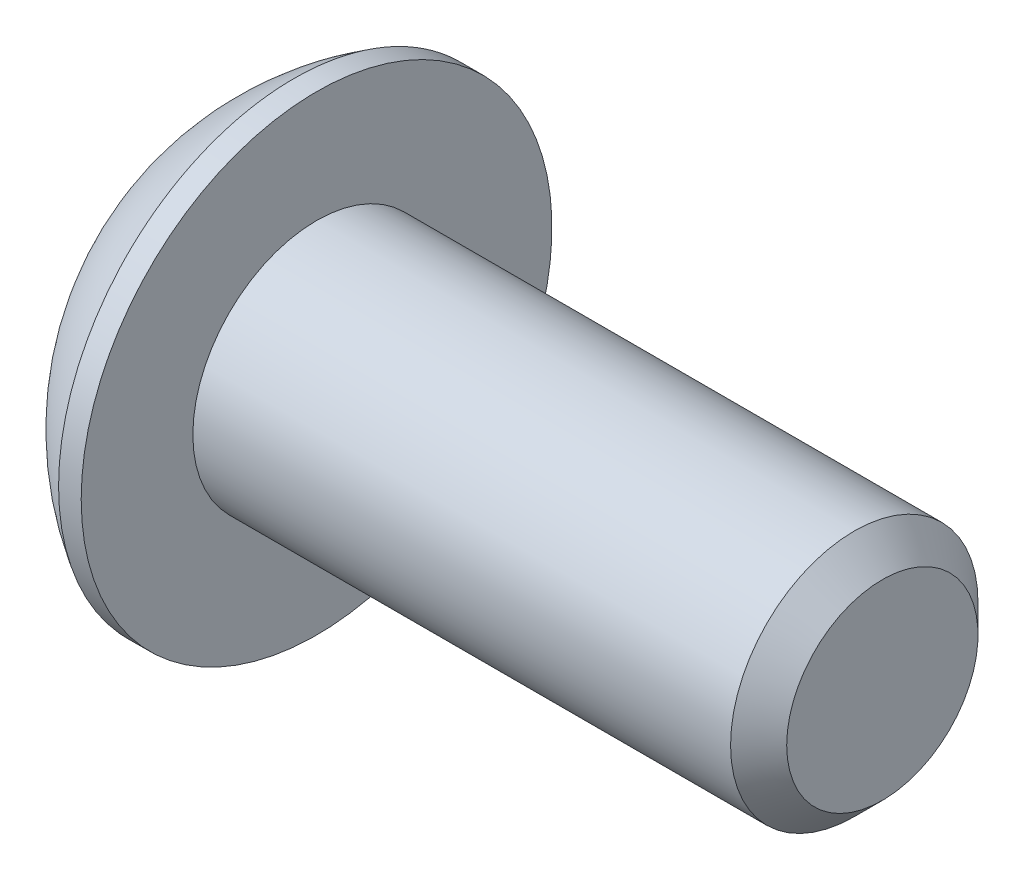
ISO-10303-21;
HEADER;
FILE_DESCRIPTION(('STEP AP214'),'2;1');
FILE_NAME('part.step','',(''),(''),'','','');
FILE_SCHEMA(('AUTOMOTIVE_DESIGN { 1 0 10303 214 1 1 1 1 }'));
ENDSEC;
DATA;
#1=APPLICATION_CONTEXT('core data for automotive mechanical design processes');
#2=APPLICATION_PROTOCOL_DEFINITION('international standard','automotive_design',2000,#1);
#3=PRODUCT_CONTEXT('',#1,'mechanical');
#4=PRODUCT('Part','Part','',(#3));
#5=PRODUCT_RELATED_PRODUCT_CATEGORY('part','',(#4));
#6=PRODUCT_DEFINITION_FORMATION('','',#4);
#7=PRODUCT_DEFINITION_CONTEXT('part definition',#1,'design');
#8=PRODUCT_DEFINITION('design','',#6,#7);
#9=PRODUCT_DEFINITION_SHAPE('','',#8);
#10=(LENGTH_UNIT() NAMED_UNIT(*) SI_UNIT(.MILLI.,.METRE.));
#11=(NAMED_UNIT(*) PLANE_ANGLE_UNIT() SI_UNIT($,.RADIAN.));
#12=(NAMED_UNIT(*) SI_UNIT($,.STERADIAN.) SOLID_ANGLE_UNIT());
#13=UNCERTAINTY_MEASURE_WITH_UNIT(LENGTH_MEASURE(1.E-05),#10,'distance_accuracy_value','');
#14=(GEOMETRIC_REPRESENTATION_CONTEXT(3) GLOBAL_UNCERTAINTY_ASSIGNED_CONTEXT((#13)) GLOBAL_UNIT_ASSIGNED_CONTEXT((#10,
#11,#12)) REPRESENTATION_CONTEXT('',''));
#15=CARTESIAN_POINT('',(0.,0.,0.));
#16=DIRECTION('',(0.,0.,1.));
#17=DIRECTION('',(1.,0.,0.));
#18=AXIS2_PLACEMENT_3D('',#15,#16,#17);
#19=CARTESIAN_POINT('',(1.32080000000034,0.,0.));
#20=DIRECTION('',(-1.,0.,0.));
#21=DIRECTION('',(0.,0.,1.));
#22=AXIS2_PLACEMENT_3D('',#19,#20,#21);
#23=CONICAL_SURFACE('',#22,1.1937999999998,1.04719755119608);
#24=CARTESIAN_POINT('',(2.01004075135902,0.,4.44089209850063E-13));
#25=VERTEX_POINT('',#24);
#26=VERTEX_LOOP('',#25);
#27=FACE_BOUND('',#26,.T.);
#28=CARTESIAN_POINT('',(1.32080000000009,0.,0.));
#29=DIRECTION('',(-1.,0.,0.));
#30=DIRECTION('',(0.,0.,1.));
#31=AXIS2_PLACEMENT_3D('',#28,#29,#30);
#32=CIRCLE('',#31,1.19380000000024);
#33=CARTESIAN_POINT('',(1.32080000000004,-1.03386112703797,0.59690000000006));
#34=VERTEX_POINT('',#33);
#35=CARTESIAN_POINT('',(1.32080000000004,0.,1.19380000000012));
#36=VERTEX_POINT('',#35);
#37=EDGE_CURVE('E18',#34,#36,#32,.T.);
#38=ORIENTED_EDGE('',*,*,#37,.T.);
#39=CARTESIAN_POINT('',(1.32080000000009,0.,0.));
#40=DIRECTION('',(-1.,0.,0.));
#41=DIRECTION('',(0.,0.,1.));
#42=AXIS2_PLACEMENT_3D('',#39,#40,#41);
#43=CIRCLE('',#42,1.19380000000024);
#44=CARTESIAN_POINT('',(1.32080000000004,1.03386112703797,0.596900000000061));
#45=VERTEX_POINT('',#44);
#46=EDGE_CURVE('E139',#36,#45,#43,.T.);
#47=ORIENTED_EDGE('',*,*,#46,.T.);
#48=CARTESIAN_POINT('',(1.32080000000009,0.,0.));
#49=DIRECTION('',(-1.,0.,0.));
#50=DIRECTION('',(0.,0.,1.));
#51=AXIS2_PLACEMENT_3D('',#48,#49,#50);
#52=CIRCLE('',#51,1.19380000000024);
#53=CARTESIAN_POINT('',(1.32080000000004,1.03386112703797,-0.596900000000061));
#54=VERTEX_POINT('',#53);
#55=EDGE_CURVE('E368',#45,#54,#52,.T.);
#56=ORIENTED_EDGE('',*,*,#55,.T.);
#57=CARTESIAN_POINT('',(1.32080000000009,0.,0.));
#58=DIRECTION('',(-1.,0.,0.));
#59=DIRECTION('',(0.,0.,1.));
#60=AXIS2_PLACEMENT_3D('',#57,#58,#59);
#61=CIRCLE('',#60,1.19380000000024);
#62=CARTESIAN_POINT('',(1.32080000000004,1.49457637585666E-12,-1.19380000000012));
#63=VERTEX_POINT('',#62);
#64=EDGE_CURVE('E366',#54,#63,#61,.T.);
#65=ORIENTED_EDGE('',*,*,#64,.T.);
#66=CARTESIAN_POINT('',(1.32080000000009,0.,0.));
#67=DIRECTION('',(-1.,0.,0.));
#68=DIRECTION('',(0.,0.,1.));
#69=AXIS2_PLACEMENT_3D('',#66,#67,#68);
#70=CIRCLE('',#69,1.19380000000024);
#71=CARTESIAN_POINT('',(1.32080000000004,-1.03386112703797,-0.59690000000006));
#72=VERTEX_POINT('',#71);
#73=EDGE_CURVE('E91',#63,#72,#70,.T.);
#74=ORIENTED_EDGE('',*,*,#73,.T.);
#75=CARTESIAN_POINT('',(1.32080000000009,0.,0.));
#76=DIRECTION('',(-1.,0.,0.));
#77=DIRECTION('',(0.,0.,1.));
#78=AXIS2_PLACEMENT_3D('',#75,#76,#77);
#79=CIRCLE('',#78,1.19380000000024);
#80=EDGE_CURVE('E87',#72,#34,#79,.T.);
#81=ORIENTED_EDGE('',*,*,#80,.T.);
#82=EDGE_LOOP('',(#38,#47,#56,#65,#74,#81));
#83=FACE_BOUND('',#82,.T.);
#84=ADVANCED_FACE('F14',(#27,#83),#23,.F.);
#85=CARTESIAN_POINT('',(1.3208,-2.06772225407572,-1.1938));
#86=DIRECTION('',(1.,0.,0.));
#87=DIRECTION('',(0.,0.,-1.));
#88=AXIS2_PLACEMENT_3D('',#85,#86,#87);
#89=PLANE('',#88);
#90=DIRECTION('',(0.,0.5,0.866025403784439));
#91=VECTOR('',#90,1.);
#92=CARTESIAN_POINT('',(1.3208,-1.37848150271715,0.));
#93=LINE('',#92,#91);
#94=CARTESIAN_POINT('',(1.3208,-0.689240751358574,1.1938));
#95=VERTEX_POINT('',#94);
#96=EDGE_CURVE('E99',#95,#34,#93,.F.);
#97=ORIENTED_EDGE('',*,*,#96,.F.);
#98=DIRECTION('',(0.,1.,0.));
#99=VECTOR('',#98,1.);
#100=CARTESIAN_POINT('',(1.3208,-0.689240751358574,1.1938));
#101=LINE('',#100,#99);
#102=EDGE_CURVE('E101',#36,#95,#101,.F.);
#103=ORIENTED_EDGE('',*,*,#102,.F.);
#104=ORIENTED_EDGE('',*,*,#37,.F.);
#105=EDGE_LOOP('',(#97,#103,#104));
#106=FACE_BOUND('',#105,.T.);
#107=ADVANCED_FACE('F97',(#106),#89,.F.);
#108=CARTESIAN_POINT('',(1.3208,-2.06772225407572,-1.1938));
#109=DIRECTION('',(1.,0.,0.));
#110=DIRECTION('',(0.,0.,-1.));
#111=AXIS2_PLACEMENT_3D('',#108,#109,#110);
#112=PLANE('',#111);
#113=DIRECTION('',(0.,-0.5,0.866025403784439));
#114=VECTOR('',#113,1.);
#115=CARTESIAN_POINT('',(1.3208,-0.689240751358574,-1.1938));
#116=LINE('',#115,#114);
#117=CARTESIAN_POINT('',(1.3208,-1.37848150271715,0.));
#118=VERTEX_POINT('',#117);
#119=EDGE_CURVE('E107',#118,#72,#116,.F.);
#120=ORIENTED_EDGE('',*,*,#119,.F.);
#121=DIRECTION('',(0.,0.5,0.866025403784439));
#122=VECTOR('',#121,1.);
#123=CARTESIAN_POINT('',(1.3208,-1.37848150271715,0.));
#124=LINE('',#123,#122);
#125=EDGE_CURVE('E104',#34,#118,#124,.F.);
#126=ORIENTED_EDGE('',*,*,#125,.F.);
#127=ORIENTED_EDGE('',*,*,#80,.F.);
#128=EDGE_LOOP('',(#120,#126,#127));
#129=FACE_BOUND('',#128,.T.);
#130=ADVANCED_FACE('F105',(#129),#112,.F.);
#131=CARTESIAN_POINT('',(1.3208,-2.06772225407572,-1.1938));
#132=DIRECTION('',(1.,0.,0.));
#133=DIRECTION('',(0.,0.,-1.));
#134=AXIS2_PLACEMENT_3D('',#131,#132,#133);
#135=PLANE('',#134);
#136=DIRECTION('',(0.,1.,0.));
#137=VECTOR('',#136,1.);
#138=CARTESIAN_POINT('',(1.3208,0.689240751358577,-1.1938));
#139=LINE('',#138,#137);
#140=CARTESIAN_POINT('',(1.3208,-0.689240751358574,-1.1938));
#141=VERTEX_POINT('',#140);
#142=EDGE_CURVE('E336',#141,#63,#139,.T.);
#143=ORIENTED_EDGE('',*,*,#142,.F.);
#144=DIRECTION('',(0.,-0.5,0.866025403784439));
#145=VECTOR('',#144,1.);
#146=CARTESIAN_POINT('',(1.3208,-0.689240751358574,-1.1938));
#147=LINE('',#146,#145);
#148=EDGE_CURVE('E341',#72,#141,#147,.F.);
#149=ORIENTED_EDGE('',*,*,#148,.F.);
#150=ORIENTED_EDGE('',*,*,#73,.F.);
#151=EDGE_LOOP('',(#143,#149,#150));
#152=FACE_BOUND('',#151,.T.);
#153=ADVANCED_FACE('F182',(#152),#135,.F.);
#154=CARTESIAN_POINT('',(1.3208,-2.06772225407572,-1.1938));
#155=DIRECTION('',(1.,0.,0.));
#156=DIRECTION('',(0.,0.,-1.));
#157=AXIS2_PLACEMENT_3D('',#154,#155,#156);
#158=PLANE('',#157);
#159=DIRECTION('',(0.,-0.5,-0.866025403784439));
#160=VECTOR('',#159,1.);
#161=CARTESIAN_POINT('',(1.3208,1.37848150271715,0.));
#162=LINE('',#161,#160);
#163=CARTESIAN_POINT('',(1.3208,0.689240751358577,-1.1938));
#164=VERTEX_POINT('',#163);
#165=EDGE_CURVE('E327',#164,#54,#162,.F.);
#166=ORIENTED_EDGE('',*,*,#165,.F.);
#167=DIRECTION('',(0.,1.,0.));
#168=VECTOR('',#167,1.);
#169=CARTESIAN_POINT('',(1.3208,0.689240751358577,-1.1938));
#170=LINE('',#169,#168);
#171=EDGE_CURVE('E333',#63,#164,#170,.T.);
#172=ORIENTED_EDGE('',*,*,#171,.F.);
#173=ORIENTED_EDGE('',*,*,#64,.F.);
#174=EDGE_LOOP('',(#166,#172,#173));
#175=FACE_BOUND('',#174,.T.);
#176=ADVANCED_FACE('F178',(#175),#158,.F.);
#177=CARTESIAN_POINT('',(1.3208,-2.06772225407572,-1.1938));
#178=DIRECTION('',(1.,0.,0.));
#179=DIRECTION('',(0.,0.,-1.));
#180=AXIS2_PLACEMENT_3D('',#177,#178,#179);
#181=PLANE('',#180);
#182=DIRECTION('',(0.,0.5,-0.866025403784439));
#183=VECTOR('',#182,1.);
#184=CARTESIAN_POINT('',(1.3208,0.689240751358576,1.1938));
#185=LINE('',#184,#183);
#186=CARTESIAN_POINT('',(1.3208,1.37848150271715,0.));
#187=VERTEX_POINT('',#186);
#188=EDGE_CURVE('E314',#187,#45,#185,.F.);
#189=ORIENTED_EDGE('',*,*,#188,.F.);
#190=DIRECTION('',(0.,-0.5,-0.866025403784439));
#191=VECTOR('',#190,1.);
#192=CARTESIAN_POINT('',(1.3208,1.37848150271715,0.));
#193=LINE('',#192,#191);
#194=EDGE_CURVE('E325',#54,#187,#193,.F.);
#195=ORIENTED_EDGE('',*,*,#194,.F.);
#196=ORIENTED_EDGE('',*,*,#55,.F.);
#197=EDGE_LOOP('',(#189,#195,#196));
#198=FACE_BOUND('',#197,.T.);
#199=ADVANCED_FACE('F174',(#198),#181,.F.);
#200=CARTESIAN_POINT('',(1.3208,-2.06772225407572,-1.1938));
#201=DIRECTION('',(1.,0.,0.));
#202=DIRECTION('',(0.,0.,-1.));
#203=AXIS2_PLACEMENT_3D('',#200,#201,#202);
#204=PLANE('',#203);
#205=DIRECTION('',(0.,1.,0.));
#206=VECTOR('',#205,1.);
#207=CARTESIAN_POINT('',(1.3208,-0.689240751358574,1.1938));
#208=LINE('',#207,#206);
#209=CARTESIAN_POINT('',(1.3208,0.689240751358576,1.1938));
#210=VERTEX_POINT('',#209);
#211=EDGE_CURVE('E116',#210,#36,#208,.F.);
#212=ORIENTED_EDGE('',*,*,#211,.F.);
#213=DIRECTION('',(0.,0.5,-0.866025403784439));
#214=VECTOR('',#213,1.);
#215=CARTESIAN_POINT('',(1.3208,0.689240751358576,1.1938));
#216=LINE('',#215,#214);
#217=EDGE_CURVE('E317',#45,#210,#216,.F.);
#218=ORIENTED_EDGE('',*,*,#217,.F.);
#219=ORIENTED_EDGE('',*,*,#46,.F.);
#220=EDGE_LOOP('',(#212,#218,#219));
#221=FACE_BOUND('',#220,.T.);
#222=ADVANCED_FACE('F170',(#221),#204,.F.);
#223=CARTESIAN_POINT('',(1.3208,-0.689240751358574,1.1938));
#224=DIRECTION('',(0.,0.,-1.));
#225=DIRECTION('',(0.,1.,0.));
#226=AXIS2_PLACEMENT_3D('',#223,#224,#225);
#227=PLANE('',#226);
#228=DIRECTION('',(0.,1.,0.));
#229=VECTOR('',#228,1.);
#230=CARTESIAN_POINT('',(0.,0.,1.1938));
#231=LINE('',#230,#229);
#232=CARTESIAN_POINT('',(0.,0.689240751358577,1.1938));
#233=VERTEX_POINT('',#232);
#234=CARTESIAN_POINT('',(0.,-0.689240751358574,1.1938));
#235=VERTEX_POINT('',#234);
#236=EDGE_CURVE('E329',#233,#235,#231,.F.);
#237=ORIENTED_EDGE('',*,*,#236,.F.);
#238=DIRECTION('',(1.,0.,0.));
#239=VECTOR('',#238,1.);
#240=CARTESIAN_POINT('',(1.3208,0.689240751358576,1.1938));
#241=LINE('',#240,#239);
#242=EDGE_CURVE('E321',#210,#233,#241,.F.);
#243=ORIENTED_EDGE('',*,*,#242,.F.);
#244=ORIENTED_EDGE('',*,*,#211,.T.);
#245=ORIENTED_EDGE('',*,*,#102,.T.);
#246=DIRECTION('',(1.,0.,0.));
#247=VECTOR('',#246,1.);
#248=CARTESIAN_POINT('',(1.3208,-0.689240751358574,1.1938));
#249=LINE('',#248,#247);
#250=EDGE_CURVE('E110',#235,#95,#249,.T.);
#251=ORIENTED_EDGE('',*,*,#250,.F.);
#252=EDGE_LOOP('',(#237,#243,#244,#245,#251));
#253=FACE_BOUND('',#252,.T.);
#254=ADVANCED_FACE('F167',(#253),#227,.T.);
#255=CARTESIAN_POINT('',(1.3208,-1.37848150271715,0.));
#256=DIRECTION('',(0.,0.866025403784439,-0.5));
#257=DIRECTION('',(0.,0.5,0.866025403784439));
#258=AXIS2_PLACEMENT_3D('',#255,#256,#257);
#259=PLANE('',#258);
#260=DIRECTION('',(0.,-0.5,-0.866025403784439));
#261=VECTOR('',#260,1.);
#262=CARTESIAN_POINT('',(0.,-0.689240751358574,1.1938));
#263=LINE('',#262,#261);
#264=CARTESIAN_POINT('',(0.,-1.37848150271715,0.));
#265=VERTEX_POINT('',#264);
#266=EDGE_CURVE('E350',#235,#265,#263,.T.);
#267=ORIENTED_EDGE('',*,*,#266,.F.);
#268=ORIENTED_EDGE('',*,*,#250,.T.);
#269=ORIENTED_EDGE('',*,*,#96,.T.);
#270=ORIENTED_EDGE('',*,*,#125,.T.);
#271=DIRECTION('',(1.,0.,0.));
#272=VECTOR('',#271,1.);
#273=CARTESIAN_POINT('',(1.3208,-1.37848150271715,0.));
#274=LINE('',#273,#272);
#275=EDGE_CURVE('E119',#265,#118,#274,.T.);
#276=ORIENTED_EDGE('',*,*,#275,.F.);
#277=EDGE_LOOP('',(#267,#268,#269,#270,#276));
#278=FACE_BOUND('',#277,.T.);
#279=ADVANCED_FACE('F114',(#278),#259,.T.);
#280=CARTESIAN_POINT('',(1.3208,-0.689240751358574,-1.1938));
#281=DIRECTION('',(0.,0.866025403784439,0.5));
#282=DIRECTION('',(0.,-0.5,0.866025403784439));
#283=AXIS2_PLACEMENT_3D('',#280,#281,#282);
#284=PLANE('',#283);
#285=DIRECTION('',(0.,0.5,-0.866025403784439));
#286=VECTOR('',#285,1.);
#287=CARTESIAN_POINT('',(0.,-1.37848150271715,0.));
#288=LINE('',#287,#286);
#289=CARTESIAN_POINT('',(0.,-0.689240751358574,-1.1938));
#290=VERTEX_POINT('',#289);
#291=EDGE_CURVE('E348',#265,#290,#288,.T.);
#292=ORIENTED_EDGE('',*,*,#291,.F.);
#293=ORIENTED_EDGE('',*,*,#275,.T.);
#294=ORIENTED_EDGE('',*,*,#119,.T.);
#295=ORIENTED_EDGE('',*,*,#148,.T.);
#296=DIRECTION('',(1.,0.,0.));
#297=VECTOR('',#296,1.);
#298=CARTESIAN_POINT('',(1.3208,-0.689240751358574,-1.1938));
#299=LINE('',#298,#297);
#300=EDGE_CURVE('E332',#290,#141,#299,.T.);
#301=ORIENTED_EDGE('',*,*,#300,.F.);
#302=EDGE_LOOP('',(#292,#293,#294,#295,#301));
#303=FACE_BOUND('',#302,.T.);
#304=ADVANCED_FACE('F160',(#303),#284,.T.);
#305=CARTESIAN_POINT('',(1.3208,0.689240751358577,-1.1938));
#306=DIRECTION('',(0.,0.,1.));
#307=DIRECTION('',(1.,0.,0.));
#308=AXIS2_PLACEMENT_3D('',#305,#306,#307);
#309=PLANE('',#308);
#310=DIRECTION('',(0.,1.,0.));
#311=VECTOR('',#310,1.);
#312=CARTESIAN_POINT('',(0.,0.,-1.1938));
#313=LINE('',#312,#311);
#314=CARTESIAN_POINT('',(0.,0.689240751358577,-1.1938));
#315=VERTEX_POINT('',#314);
#316=EDGE_CURVE('E358',#290,#315,#313,.T.);
#317=ORIENTED_EDGE('',*,*,#316,.F.);
#318=ORIENTED_EDGE('',*,*,#300,.T.);
#319=ORIENTED_EDGE('',*,*,#142,.T.);
#320=ORIENTED_EDGE('',*,*,#171,.T.);
#321=DIRECTION('',(1.,0.,0.));
#322=VECTOR('',#321,1.);
#323=CARTESIAN_POINT('',(1.3208,0.689240751358577,-1.1938));
#324=LINE('',#323,#322);
#325=EDGE_CURVE('E318',#315,#164,#324,.T.);
#326=ORIENTED_EDGE('',*,*,#325,.F.);
#327=EDGE_LOOP('',(#317,#318,#319,#320,#326));
#328=FACE_BOUND('',#327,.T.);
#329=ADVANCED_FACE('F157',(#328),#309,.T.);
#330=CARTESIAN_POINT('',(1.3208,1.37848150271715,0.));
#331=DIRECTION('',(0.,-0.866025403784439,0.5));
#332=DIRECTION('',(0.,-0.5,-0.866025403784439));
#333=AXIS2_PLACEMENT_3D('',#330,#331,#332);
#334=PLANE('',#333);
#335=DIRECTION('',(0.,0.5,0.866025403784439));
#336=VECTOR('',#335,1.);
#337=CARTESIAN_POINT('',(0.,0.689240751358577,-1.1938));
#338=LINE('',#337,#336);
#339=CARTESIAN_POINT('',(0.,1.37848150271715,0.));
#340=VERTEX_POINT('',#339);
#341=EDGE_CURVE('E361',#315,#340,#338,.T.);
#342=ORIENTED_EDGE('',*,*,#341,.F.);
#343=ORIENTED_EDGE('',*,*,#325,.T.);
#344=ORIENTED_EDGE('',*,*,#165,.T.);
#345=ORIENTED_EDGE('',*,*,#194,.T.);
#346=DIRECTION('',(1.,0.,0.));
#347=VECTOR('',#346,1.);
#348=CARTESIAN_POINT('',(1.3208,1.37848150271715,0.));
#349=LINE('',#348,#347);
#350=EDGE_CURVE('E33',#340,#187,#349,.T.);
#351=ORIENTED_EDGE('',*,*,#350,.F.);
#352=EDGE_LOOP('',(#342,#343,#344,#345,#351));
#353=FACE_BOUND('',#352,.T.);
#354=ADVANCED_FACE('F153',(#353),#334,.T.);
#355=CARTESIAN_POINT('',(1.3208,0.689240751358576,1.1938));
#356=DIRECTION('',(0.,-0.866025403784439,-0.5));
#357=DIRECTION('',(0.,0.5,-0.866025403784439));
#358=AXIS2_PLACEMENT_3D('',#355,#356,#357);
#359=PLANE('',#358);
#360=DIRECTION('',(0.,-0.5,0.866025403784439));
#361=VECTOR('',#360,1.);
#362=CARTESIAN_POINT('',(0.,1.37848150271715,0.));
#363=LINE('',#362,#361);
#364=EDGE_CURVE('E138',#340,#233,#363,.T.);
#365=ORIENTED_EDGE('',*,*,#364,.F.);
#366=ORIENTED_EDGE('',*,*,#350,.T.);
#367=ORIENTED_EDGE('',*,*,#188,.T.);
#368=ORIENTED_EDGE('',*,*,#217,.T.);
#369=ORIENTED_EDGE('',*,*,#242,.T.);
#370=EDGE_LOOP('',(#365,#366,#367,#368,#369));
#371=FACE_BOUND('',#370,.T.);
#372=ADVANCED_FACE('F149',(#371),#359,.T.);
#373=CARTESIAN_POINT('',(0.,0.,0.));
#374=DIRECTION('',(-1.,0.,0.));
#375=DIRECTION('',(0.,0.,1.));
#376=AXIS2_PLACEMENT_3D('',#373,#374,#375);
#377=PLANE('',#376);
#378=ORIENTED_EDGE('',*,*,#341,.T.);
#379=ORIENTED_EDGE('',*,*,#364,.T.);
#380=ORIENTED_EDGE('',*,*,#236,.T.);
#381=ORIENTED_EDGE('',*,*,#266,.T.);
#382=ORIENTED_EDGE('',*,*,#291,.T.);
#383=ORIENTED_EDGE('',*,*,#316,.T.);
#384=EDGE_LOOP('',(#378,#379,#380,#381,#382,#383));
#385=FACE_BOUND('',#384,.T.);
#386=CARTESIAN_POINT('',(0.,1.9812,0.));
#387=CARTESIAN_POINT('',(0.,1.9811996664299,0.0556258831179429));
#388=CARTESIAN_POINT('',(0.,1.97885520380442,0.111261989398606));
#389=CARTESIAN_POINT('',(0.,1.96949260169541,0.222149719830458));
#390=CARTESIAN_POINT('',(0.,1.96247308239606,0.277401225602896));
#391=CARTESIAN_POINT('',(0.,1.94379192841039,0.387209508139748));
#392=CARTESIAN_POINT('',(-1.85322098412163E-13,1.93212292489526,0.441765039546366));
#393=CARTESIAN_POINT('',(1.86340516395781E-13,1.90422331175315,0.549729449347493));
#394=CARTESIAN_POINT('',(6.9454338814387E-13,1.88798900035338,0.603137359208869));
#395=CARTESIAN_POINT('',(1.15501971975443E-12,1.832662144765,0.760839131321828));
#396=CARTESIAN_POINT('',(0.,1.78690023648845,0.86287643357543));
#397=CARTESIAN_POINT('',(0.,1.67887358150667,1.05780719540872));
#398=CARTESIAN_POINT('',(9.54252846156157E-13,1.6166082074585,1.15070030720801));
#399=CARTESIAN_POINT('',(5.94775737193293E-13,1.51224157140982,1.28116890915698));
#400=CARTESIAN_POINT('',(1.63135429314554E-13,1.47559703943539,1.32320451127027));
#401=CARTESIAN_POINT('',(-1.62111198585679E-13,1.39893832619713,1.40400288695709));
#402=CARTESIAN_POINT('',(0.,1.35892742784698,1.44276877695455));
#403=CARTESIAN_POINT('',(1.13736409396491E-13,1.23416504602197,1.55382272417904));
#404=CARTESIAN_POINT('',(0.,1.14466125559859,1.62089527952111));
#405=CARTESIAN_POINT('',(0.,0.955712144178161,1.73902218081179));
#406=CARTESIAN_POINT('',(0.,0.856267198233561,1.79007713076008));
#407=CARTESIAN_POINT('',(0.,0.65020634591084,1.87477637530954));
#408=CARTESIAN_POINT('',(0.,0.543590516134851,1.90842085586266));
#409=CARTESIAN_POINT('',(0.,0.326226155292014,1.95733039300656));
#410=CARTESIAN_POINT('',(0.,0.215477602157926,1.97259535144288));
#411=CARTESIAN_POINT('',(0.,-0.00701040587545002,1.98431697865418));
#412=CARTESIAN_POINT('',(0.,-0.118749860774737,1.98077364742916));
#413=CARTESIAN_POINT('',(0.,-0.340050178355489,1.95497485623824));
#414=CARTESIAN_POINT('',(0.,-0.449611052668259,1.93271949620217));
#415=CARTESIAN_POINT('',(0.,-0.663431110729177,1.87014138774524));
#416=CARTESIAN_POINT('',(0.,-0.767690237838523,1.82981844635272));
#417=CARTESIAN_POINT('',(0.,-0.968005760719348,1.73219968377096));
#418=CARTESIAN_POINT('',(0.,-1.0640618469811,1.6749032225164));
#419=CARTESIAN_POINT('',(0.,-1.19980276751283,1.57757371205873));
#420=CARTESIAN_POINT('',(0.,-1.24366557129214,1.54322665019466));
#421=CARTESIAN_POINT('',(0.,-1.32838995706696,1.47093063174264));
#422=CARTESIAN_POINT('',(0.,-1.36924860178706,1.43297823102439));
#423=CARTESIAN_POINT('',(0.,-1.48674671849223,1.31419842051172));
#424=CARTESIAN_POINT('',(0.,-1.55842832343237,1.22836221289311));
#425=CARTESIAN_POINT('',(0.,-1.6863396856475,1.04586168272493));
#426=CARTESIAN_POINT('',(0.,-1.7425700302488,0.949197771949769));
#427=CARTESIAN_POINT('',(0.,-1.8141614250401,0.798182600298679));
#428=CARTESIAN_POINT('',(0.,-1.83591780585875,0.746776203847787));
#429=CARTESIAN_POINT('',(0.,-1.87500754181092,0.642341081688632));
#430=CARTESIAN_POINT('',(0.,-1.89234447645404,0.589313708122843));
#431=CARTESIAN_POINT('',(0.,-1.92246053433555,0.482076273028391));
#432=CARTESIAN_POINT('',(0.,-1.93524685475118,0.427868224257506));
#433=CARTESIAN_POINT('',(0.,-1.95620937250494,0.318578151844607));
#434=CARTESIAN_POINT('',(0.,-1.96438692958147,0.263496390912868));
#435=CARTESIAN_POINT('',(0.,-1.97388528284653,0.173607715038555));
#436=CARTESIAN_POINT('',(0.,-1.97662743364426,0.138944718024995));
#437=CARTESIAN_POINT('',(0.,-1.98028489645283,0.069522478256699));
#438=CARTESIAN_POINT('',(0.,-1.98120020846367,0.0347632355019625));
#439=CARTESIAN_POINT('',(0.,-1.9811996664299,-0.0556258831179437));
#440=CARTESIAN_POINT('',(0.,-1.97885520380442,-0.111261989398607));
#441=CARTESIAN_POINT('',(0.,-1.96949260169541,-0.222149719830459));
#442=CARTESIAN_POINT('',(0.,-1.96247308239605,-0.277401225602897));
#443=CARTESIAN_POINT('',(0.,-1.94379192841039,-0.387209508139749));
#444=CARTESIAN_POINT('',(-1.85273829369933E-13,-1.93212292489526,-0.441765039546367));
#445=CARTESIAN_POINT('',(1.86292208101257E-13,-1.90422331175315,-0.549729449347495));
#446=CARTESIAN_POINT('',(6.94526512411752E-13,-1.88798900035338,-0.603137359208872));
#447=CARTESIAN_POINT('',(1.15505339077404E-12,-1.83266214476501,-0.760839131321831));
#448=CARTESIAN_POINT('',(0.,-1.78690023648846,-0.862876433575432));
#449=CARTESIAN_POINT('',(0.,-1.67887358150667,-1.05780719540872));
#450=CARTESIAN_POINT('',(9.54248949793369E-13,-1.6166082074585,-1.15070030720801));
#451=CARTESIAN_POINT('',(5.94777687927534E-13,-1.51224157140982,-1.28116890915698));
#452=CARTESIAN_POINT('',(1.63138929838936E-13,-1.4755970394354,-1.32320451127027));
#453=CARTESIAN_POINT('',(-1.62114695735028E-13,-1.39893832619713,-1.40400288695709));
#454=CARTESIAN_POINT('',(0.,-1.35892742784699,-1.44276877695455));
#455=CARTESIAN_POINT('',(1.13760471433616E-13,-1.23416504602197,-1.55382272417904));
#456=CARTESIAN_POINT('',(0.,-1.14466125559859,-1.62089527952111));
#457=CARTESIAN_POINT('',(0.,-0.95571214417816,-1.73902218081179));
#458=CARTESIAN_POINT('',(0.,-0.856267198233559,-1.79007713076007));
#459=CARTESIAN_POINT('',(0.,-0.650206345910841,-1.87477637530954));
#460=CARTESIAN_POINT('',(0.,-0.543590516134854,-1.90842085586267));
#461=CARTESIAN_POINT('',(0.,-0.326226155292018,-1.95733039300657));
#462=CARTESIAN_POINT('',(0.,-0.215477602157928,-1.97259535144288));
#463=CARTESIAN_POINT('',(0.,0.00701040587544881,-1.98431697865418));
#464=CARTESIAN_POINT('',(0.,0.118749860774737,-1.98077364742916));
#465=CARTESIAN_POINT('',(0.,0.340050178355489,-1.95497485623824));
#466=CARTESIAN_POINT('',(0.,0.44961105266826,-1.93271949620218));
#467=CARTESIAN_POINT('',(0.,0.663431110729178,-1.87014138774524));
#468=CARTESIAN_POINT('',(0.,0.767690237838524,-1.82981844635272));
#469=CARTESIAN_POINT('',(0.,0.968005760719347,-1.73219968377096));
#470=CARTESIAN_POINT('',(0.,1.0640618469811,-1.67490322251639));
#471=CARTESIAN_POINT('',(0.,1.19980276751283,-1.57757371205873));
#472=CARTESIAN_POINT('',(0.,1.24366557129214,-1.54322665019465));
#473=CARTESIAN_POINT('',(0.,1.32838995706696,-1.47093063174263));
#474=CARTESIAN_POINT('',(0.,1.36924860178706,-1.43297823102439));
#475=CARTESIAN_POINT('',(0.,1.48674671849223,-1.31419842051172));
#476=CARTESIAN_POINT('',(0.,1.55842832343237,-1.22836221289311));
#477=CARTESIAN_POINT('',(0.,1.6863396856475,-1.04586168272493));
#478=CARTESIAN_POINT('',(0.,1.7425700302488,-0.94919777194977));
#479=CARTESIAN_POINT('',(0.,1.8141614250401,-0.798182600298679));
#480=CARTESIAN_POINT('',(0.,1.83591780585875,-0.746776203847786));
#481=CARTESIAN_POINT('',(0.,1.87500754181092,-0.642341081688631));
#482=CARTESIAN_POINT('',(0.,1.89234447645404,-0.589313708122842));
#483=CARTESIAN_POINT('',(0.,1.92246053433555,-0.482076273028391));
#484=CARTESIAN_POINT('',(0.,1.93524685475118,-0.427868224257506));
#485=CARTESIAN_POINT('',(0.,1.95620937250494,-0.318578151844607));
#486=CARTESIAN_POINT('',(0.,1.96438692958147,-0.263496390912867));
#487=CARTESIAN_POINT('',(0.,1.97388528284653,-0.173607715038554));
#488=CARTESIAN_POINT('',(0.,1.97662743364426,-0.138944718024995));
#489=CARTESIAN_POINT('',(0.,1.98028489645283,-0.0695224782566994));
#490=CARTESIAN_POINT('',(0.,1.98120020846367,-0.0347632355019633));
#491=CARTESIAN_POINT('',(0.,1.9812,0.));
#492=B_SPLINE_CURVE_WITH_KNOTS('',3,(#386,#387,#388,#389,#390,#391,#392,#393,#394,#395,#396,
#397,#398,#399,#400,#401,#402,#403,#404,#405,#406,#407,#408,#409,#410,#411,#412,#413,#414,#415,
#416,#417,#418,#419,#420,#421,#422,#423,#424,#425,#426,#427,#428,#429,#430,#431,#432,#433,#434,
#435,#436,#437,#438,#439,#440,#441,#442,#443,#444,#445,#446,#447,#448,#449,#450,#451,#452,#453,
#454,#455,#456,#457,#458,#459,#460,#461,#462,#463,#464,#465,#466,#467,#468,#469,#470,#471,#472,
#473,#474,#475,#476,#477,#478,#479,#480,#481,#482,#483,#484,#485,#486,#487,#488,#489,#490,#491),
.UNSPECIFIED.,.T.,.F.,(4,2,2,2,2,2,2,2,2,2,2,2,2,2,2,2,2,2,2,2,2,2,2,2,2,2,2,2,2,2,2,2,2,2,2,2,
2,2,2,2,2,2,2,2,2,2,2,2,2,2,2,2,4),(0.,0.166845646007828,0.333740557374256,0.500901034367694,
0.668197445942387,1.00199278686282,1.33580081809885,1.50292354032982,1.6698851310853,
2.00370118900129,2.33750465770544,2.67130456115909,3.00510624723801,3.33890793331696,
3.67270783677065,4.00651130547476,4.34032736339026,4.50728895414554,4.67441167637632,
5.0082197076126,5.34201504853333,5.50931146010827,5.67647193710192,5.84336684846844,
6.01021249447641,6.11448220058334,6.21875190669029,6.38559755269811,6.55249246406454,
6.71965294105798,6.88694935263267,7.22074469355311,7.55455272478914,7.72167544702011,
7.88863703777559,8.22245309569158,8.55625656439573,8.89005646784938,9.2238581539283,
9.55765984000725,9.89145974346094,10.225263212165,10.5590792700806,10.7260408608358,
10.8931635830666,11.2269716143029,11.5607669552236,11.7280633667986,11.8952238437922,
12.0621187551587,12.2289644011667,12.3332341072736,12.4375038133806),.UNSPECIFIED.);
#493=CARTESIAN_POINT('',(0.,1.9812,0.));
#494=VERTEX_POINT('',#493);
#495=EDGE_CURVE('E131',#494,#494,#492,.T.);
#496=ORIENTED_EDGE('',*,*,#495,.F.);
#497=EDGE_LOOP('',(#496));
#498=FACE_BOUND('',#497,.T.);
#499=ADVANCED_FACE('F145',(#385,#498),#377,.T.);
#500=CARTESIAN_POINT('',(4.13385,0.,0.));
#501=DIRECTION('',(0.,1.,0.));
#502=DIRECTION('',(1.,0.,0.));
#503=AXIS2_PLACEMENT_3D('',#500,#501,#502);
#504=SPHERICAL_SURFACE('',#503,4.58408870578439);
#505=CARTESIAN_POINT('',(1.8288,0.,0.));
#506=DIRECTION('',(-1.,0.,0.));
#507=DIRECTION('',(0.,0.,1.));
#508=AXIS2_PLACEMENT_3D('',#505,#506,#507);
#509=CIRCLE('',#508,3.9624);
#510=CARTESIAN_POINT('',(1.8288,0.,3.9624));
#511=VERTEX_POINT('',#510);
#512=EDGE_CURVE('E128',#511,#511,#509,.F.);
#513=ORIENTED_EDGE('',*,*,#512,.F.);
#514=EDGE_LOOP('',(#513));
#515=FACE_BOUND('',#514,.T.);
#516=ORIENTED_EDGE('',*,*,#495,.T.);
#517=EDGE_LOOP('',(#516));
#518=FACE_BOUND('',#517,.T.);
#519=ADVANCED_FACE('F141',(#515,#518),#504,.T.);
#520=CARTESIAN_POINT('',(11.7348,0.,0.));
#521=DIRECTION('',(-1.,0.,0.));
#522=DIRECTION('',(0.,0.,1.));
#523=AXIS2_PLACEMENT_3D('',#520,#521,#522);
#524=PLANE('',#523);
#525=CARTESIAN_POINT('',(11.7347999999424,0.,0.));
#526=DIRECTION('',(-1.,0.,0.));
#527=DIRECTION('',(0.,0.,1.));
#528=AXIS2_PLACEMENT_3D('',#525,#526,#527);
#529=CIRCLE('',#528,1.61036000002923);
#530=CARTESIAN_POINT('',(11.7347999999424,0.,1.61036000002923));
#531=VERTEX_POINT('',#530);
#532=EDGE_CURVE('E125',#531,#531,#529,.T.);
#533=ORIENTED_EDGE('',*,*,#532,.F.);
#534=EDGE_LOOP('',(#533));
#535=FACE_BOUND('',#534,.T.);
#536=ADVANCED_FACE('F213',(#535),#524,.F.);
#537=CARTESIAN_POINT('',(0.,0.,0.));
#538=DIRECTION('',(-1.,0.,0.));
#539=DIRECTION('',(0.,0.,1.));
#540=AXIS2_PLACEMENT_3D('',#537,#538,#539);
#541=CYLINDRICAL_SURFACE('',#540,3.9624);
#542=ORIENTED_EDGE('',*,*,#512,.T.);
#543=EDGE_LOOP('',(#542));
#544=FACE_BOUND('',#543,.T.);
#545=CARTESIAN_POINT('',(2.2098,0.,0.));
#546=DIRECTION('',(-1.,0.,0.));
#547=DIRECTION('',(0.,0.,1.));
#548=AXIS2_PLACEMENT_3D('',#545,#546,#547);
#549=CIRCLE('',#548,3.9624);
#550=CARTESIAN_POINT('',(2.2098,0.,3.9624));
#551=VERTEX_POINT('',#550);
#552=EDGE_CURVE('E122',#551,#551,#549,.T.);
#553=ORIENTED_EDGE('',*,*,#552,.T.);
#554=EDGE_LOOP('',(#553));
#555=FACE_BOUND('',#554,.T.);
#556=ADVANCED_FACE('F211',(#544,#555),#541,.T.);
#557=CARTESIAN_POINT('',(11.2623600000461,0.,0.));
#558=DIRECTION('',(-1.,0.,0.));
#559=DIRECTION('',(0.,0.,1.));
#560=AXIS2_PLACEMENT_3D('',#557,#558,#559);
#561=CONICAL_SURFACE('',#560,2.08279999992556,0.785398163397448);
#562=ORIENTED_EDGE('',*,*,#532,.T.);
#563=EDGE_LOOP('',(#562));
#564=FACE_BOUND('',#563,.T.);
#565=CARTESIAN_POINT('',(11.26236,0.,0.));
#566=DIRECTION('',(-1.,0.,0.));
#567=DIRECTION('',(0.,0.,1.));
#568=AXIS2_PLACEMENT_3D('',#565,#566,#567);
#569=CIRCLE('',#568,2.0828);
#570=CARTESIAN_POINT('',(11.26236,0.,2.0828));
#571=VERTEX_POINT('',#570);
#572=EDGE_CURVE('E24',#571,#571,#569,.T.);
#573=ORIENTED_EDGE('',*,*,#572,.F.);
#574=EDGE_LOOP('',(#573));
#575=FACE_BOUND('',#574,.T.);
#576=ADVANCED_FACE('F202',(#564,#575),#561,.T.);
#577=CARTESIAN_POINT('',(2.2098,2.0828,0.));
#578=DIRECTION('',(-1.,0.,0.));
#579=DIRECTION('',(0.,0.,1.));
#580=AXIS2_PLACEMENT_3D('',#577,#578,#579);
#581=PLANE('',#580);
#582=CARTESIAN_POINT('',(2.2098,0.,0.));
#583=DIRECTION('',(-1.,0.,0.));
#584=DIRECTION('',(0.,0.,1.));
#585=AXIS2_PLACEMENT_3D('',#582,#583,#584);
#586=CIRCLE('',#585,2.0828);
#587=CARTESIAN_POINT('',(2.2098,0.,2.0828));
#588=VERTEX_POINT('',#587);
#589=EDGE_CURVE('E9',#588,#588,#586,.F.);
#590=ORIENTED_EDGE('',*,*,#589,.F.);
#591=EDGE_LOOP('',(#590));
#592=FACE_BOUND('',#591,.T.);
#593=ORIENTED_EDGE('',*,*,#552,.F.);
#594=EDGE_LOOP('',(#593));
#595=FACE_BOUND('',#594,.T.);
#596=ADVANCED_FACE('F197',(#592,#595),#581,.F.);
#597=CARTESIAN_POINT('',(0.,0.,0.));
#598=DIRECTION('',(-1.,0.,0.));
#599=DIRECTION('',(0.,0.,1.));
#600=AXIS2_PLACEMENT_3D('',#597,#598,#599);
#601=CYLINDRICAL_SURFACE('',#600,2.0828);
#602=ORIENTED_EDGE('',*,*,#572,.T.);
#603=EDGE_LOOP('',(#602));
#604=FACE_BOUND('',#603,.T.);
#605=ORIENTED_EDGE('',*,*,#589,.T.);
#606=EDGE_LOOP('',(#605));
#607=FACE_BOUND('',#606,.T.);
#608=ADVANCED_FACE('F16',(#604,#607),#601,.T.);
#609=CLOSED_SHELL('',(#84,#107,#130,#153,#176,#199,#222,#254,#279,#304,#329,#354,#372,#499,#519,
#536,#556,#576,#596,#608));
#610=MANIFOLD_SOLID_BREP('B1',#609);
#611=ADVANCED_BREP_SHAPE_REPRESENTATION('',(#18,#610),#14);
#612=SHAPE_DEFINITION_REPRESENTATION(#9,#611);
ENDSEC;
END-ISO-10303-21;
